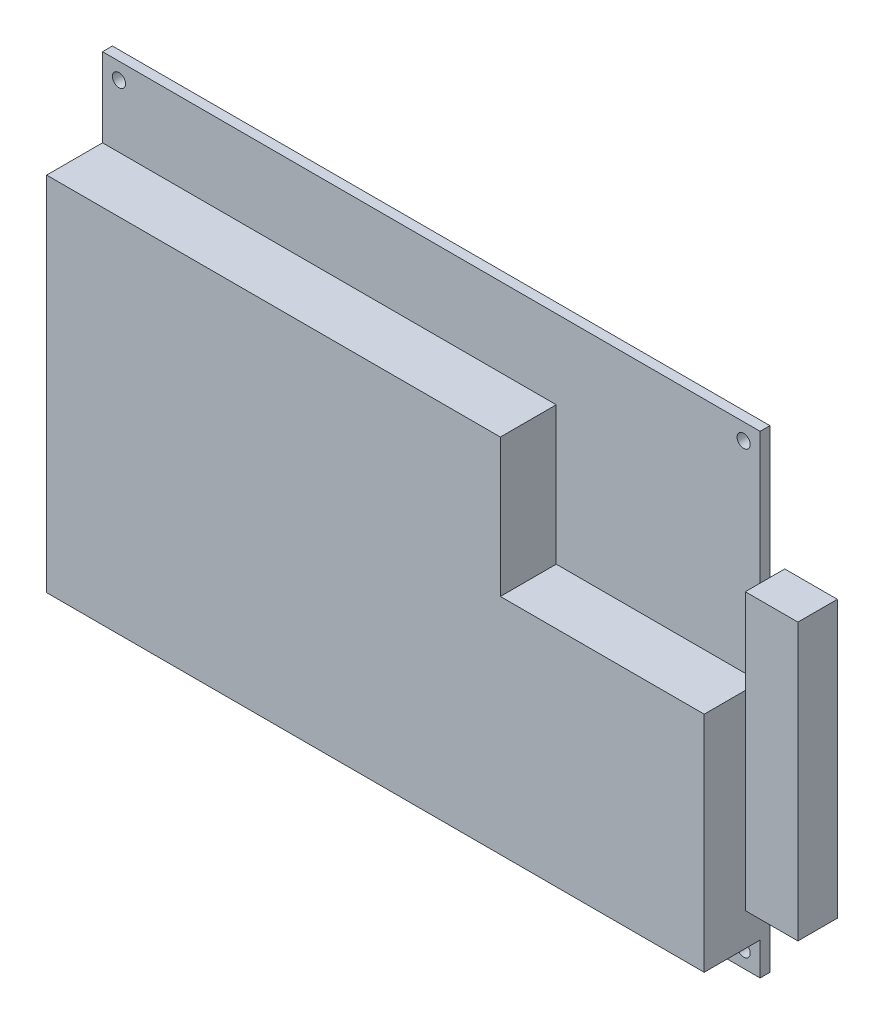
ISO-10303-21;
HEADER;
FILE_DESCRIPTION(('STEP AP214'),'2;1');
FILE_NAME('part.step','',(''),(''),'','','');
FILE_SCHEMA(('AUTOMOTIVE_DESIGN { 1 0 10303 214 1 1 1 1 }'));
ENDSEC;
DATA;
#1=APPLICATION_CONTEXT('core data for automotive mechanical design processes');
#2=APPLICATION_PROTOCOL_DEFINITION('international standard','automotive_design',2000,#1);
#3=PRODUCT_CONTEXT('',#1,'mechanical');
#4=PRODUCT('Part','Part','',(#3));
#5=PRODUCT_RELATED_PRODUCT_CATEGORY('part','',(#4));
#6=PRODUCT_DEFINITION_FORMATION('','',#4);
#7=PRODUCT_DEFINITION_CONTEXT('part definition',#1,'design');
#8=PRODUCT_DEFINITION('design','',#6,#7);
#9=PRODUCT_DEFINITION_SHAPE('','',#8);
#10=(LENGTH_UNIT() NAMED_UNIT(*) SI_UNIT(.MILLI.,.METRE.));
#11=(NAMED_UNIT(*) PLANE_ANGLE_UNIT() SI_UNIT($,.RADIAN.));
#12=(NAMED_UNIT(*) SI_UNIT($,.STERADIAN.) SOLID_ANGLE_UNIT());
#13=UNCERTAINTY_MEASURE_WITH_UNIT(LENGTH_MEASURE(1.E-05),#10,'distance_accuracy_value','');
#14=(GEOMETRIC_REPRESENTATION_CONTEXT(3) GLOBAL_UNCERTAINTY_ASSIGNED_CONTEXT((#13)) GLOBAL_UNIT_ASSIGNED_CONTEXT((#10,
#11,#12)) REPRESENTATION_CONTEXT('',''));
#15=CARTESIAN_POINT('',(0.,0.,0.));
#16=DIRECTION('',(0.,0.,1.));
#17=DIRECTION('',(1.,0.,0.));
#18=AXIS2_PLACEMENT_3D('',#15,#16,#17);
#19=CARTESIAN_POINT('',(100.,72.,1.5));
#20=DIRECTION('',(-1.,0.,0.));
#21=DIRECTION('',(0.,-1.,0.));
#22=AXIS2_PLACEMENT_3D('',#19,#20,#21);
#23=PLANE('',#22);
#24=DIRECTION('',(0.,0.,1.));
#25=VECTOR('',#24,1.);
#26=CARTESIAN_POINT('',(100.,52.,3.75));
#27=LINE('',#26,#25);
#28=CARTESIAN_POINT('',(100.,52.,0.));
#29=VERTEX_POINT('',#28);
#30=CARTESIAN_POINT('',(100.,52.,1.5));
#31=VERTEX_POINT('',#30);
#32=EDGE_CURVE('E11',#29,#31,#27,.T.);
#33=ORIENTED_EDGE('',*,*,#32,.F.);
#34=DIRECTION('',(0.,1.,0.));
#35=VECTOR('',#34,1.);
#36=CARTESIAN_POINT('',(100.,72.,0.));
#37=LINE('',#36,#35);
#38=CARTESIAN_POINT('',(100.,72.,0.));
#39=VERTEX_POINT('',#38);
#40=EDGE_CURVE('E239',#29,#39,#37,.T.);
#41=ORIENTED_EDGE('',*,*,#40,.T.);
#42=DIRECTION('',(0.,0.,-1.));
#43=VECTOR('',#42,1.);
#44=CARTESIAN_POINT('',(100.,72.,1.5));
#45=LINE('',#44,#43);
#46=CARTESIAN_POINT('',(100.,72.,1.5));
#47=VERTEX_POINT('',#46);
#48=EDGE_CURVE('E36',#47,#39,#45,.T.);
#49=ORIENTED_EDGE('',*,*,#48,.F.);
#50=DIRECTION('',(0.,1.,0.));
#51=VECTOR('',#50,1.);
#52=CARTESIAN_POINT('',(100.,72.,1.5));
#53=LINE('',#52,#51);
#54=EDGE_CURVE('E246',#31,#47,#53,.T.);
#55=ORIENTED_EDGE('',*,*,#54,.F.);
#56=EDGE_LOOP('',(#33,#41,#49,#55));
#57=FACE_BOUND('',#56,.T.);
#58=ADVANCED_FACE('F33',(#57),#23,.F.);
#59=DIRECTION('',(0.,-1.,0.));
#60=VECTOR('',#59,1.);
#61=CARTESIAN_POINT('',(100.,52.,3.75));
#62=LINE('',#61,#60);
#63=CARTESIAN_POINT('',(100.,39.,3.75));
#64=VERTEX_POINT('',#63);
#65=CARTESIAN_POINT('',(100.,9.99999999999998,3.75));
#66=VERTEX_POINT('',#65);
#67=EDGE_CURVE('E41',#64,#66,#62,.T.);
#68=ORIENTED_EDGE('',*,*,#67,.F.);
#69=DIRECTION('',(0.,0.,-1.));
#70=VECTOR('',#69,1.);
#71=CARTESIAN_POINT('',(100.,39.,10.));
#72=LINE('',#71,#70);
#73=CARTESIAN_POINT('',(100.,39.,10.));
#74=VERTEX_POINT('',#73);
#75=EDGE_CURVE('E209',#74,#64,#72,.T.);
#76=ORIENTED_EDGE('',*,*,#75,.F.);
#77=DIRECTION('',(0.,1.,0.));
#78=VECTOR('',#77,1.);
#79=CARTESIAN_POINT('',(100.,39.,10.));
#80=LINE('',#79,#78);
#81=CARTESIAN_POINT('',(100.,4.99999999999998,10.));
#82=VERTEX_POINT('',#81);
#83=EDGE_CURVE('E184',#82,#74,#80,.T.);
#84=ORIENTED_EDGE('',*,*,#83,.F.);
#85=DIRECTION('',(0.,0.,-1.));
#86=VECTOR('',#85,1.);
#87=CARTESIAN_POINT('',(100.,4.99999999999998,10.));
#88=LINE('',#87,#86);
#89=CARTESIAN_POINT('',(100.,4.99999999999998,1.5));
#90=VERTEX_POINT('',#89);
#91=EDGE_CURVE('E211',#82,#90,#88,.T.);
#92=ORIENTED_EDGE('',*,*,#91,.T.);
#93=CARTESIAN_POINT('',(100.,0.,1.5));
#94=VERTEX_POINT('',#93);
#95=EDGE_CURVE('E242',#94,#90,#53,.T.);
#96=ORIENTED_EDGE('',*,*,#95,.F.);
#97=DIRECTION('',(0.,0.,-1.));
#98=VECTOR('',#97,1.);
#99=CARTESIAN_POINT('',(100.,0.,1.5));
#100=LINE('',#99,#98);
#101=CARTESIAN_POINT('',(100.,0.,0.));
#102=VERTEX_POINT('',#101);
#103=EDGE_CURVE('E253',#94,#102,#100,.T.);
#104=ORIENTED_EDGE('',*,*,#103,.T.);
#105=CARTESIAN_POINT('',(100.,9.99999999999998,0.));
#106=VERTEX_POINT('',#105);
#107=EDGE_CURVE('E254',#102,#106,#37,.T.);
#108=ORIENTED_EDGE('',*,*,#107,.T.);
#109=DIRECTION('',(0.,0.,-1.));
#110=VECTOR('',#109,1.);
#111=CARTESIAN_POINT('',(100.,9.99999999999998,3.75));
#112=LINE('',#111,#110);
#113=EDGE_CURVE('E51',#66,#106,#112,.T.);
#114=ORIENTED_EDGE('',*,*,#113,.F.);
#115=EDGE_LOOP('',(#68,#76,#84,#92,#96,#104,#108,#114));
#116=FACE_BOUND('',#115,.T.);
#117=ADVANCED_FACE('F342',(#116),#23,.F.);
#118=CARTESIAN_POINT('',(0.,0.,1.5));
#119=DIRECTION('',(0.,0.,-1.));
#120=DIRECTION('',(-1.,0.,0.));
#121=AXIS2_PLACEMENT_3D('',#118,#119,#120);
#122=PLANE('',#121);
#123=CARTESIAN_POINT('',(97.5,69.5,1.5));
#124=DIRECTION('',(0.,0.,1.));
#125=DIRECTION('',(1.,0.,0.));
#126=AXIS2_PLACEMENT_3D('',#123,#124,#125);
#127=CIRCLE('',#126,0.999999999999998);
#128=CARTESIAN_POINT('',(98.5,69.5,1.5));
#129=VERTEX_POINT('',#128);
#130=EDGE_CURVE('E224',#129,#129,#127,.T.);
#131=ORIENTED_EDGE('',*,*,#130,.F.);
#132=EDGE_LOOP('',(#131));
#133=FACE_BOUND('',#132,.T.);
#134=CARTESIAN_POINT('',(2.5,69.5,1.5));
#135=DIRECTION('',(0.,0.,1.));
#136=DIRECTION('',(1.,0.,0.));
#137=AXIS2_PLACEMENT_3D('',#134,#135,#136);
#138=CIRCLE('',#137,1.);
#139=CARTESIAN_POINT('',(3.5,69.5,1.5));
#140=VERTEX_POINT('',#139);
#141=EDGE_CURVE('E230',#140,#140,#138,.T.);
#142=ORIENTED_EDGE('',*,*,#141,.F.);
#143=EDGE_LOOP('',(#142));
#144=FACE_BOUND('',#143,.T.);
#145=DIRECTION('',(-1.,0.,0.));
#146=VECTOR('',#145,1.);
#147=CARTESIAN_POINT('',(0.,60.,1.5));
#148=LINE('',#147,#146);
#149=CARTESIAN_POINT('',(69.,60.,1.5));
#150=VERTEX_POINT('',#149);
#151=CARTESIAN_POINT('',(0.,60.,1.5));
#152=VERTEX_POINT('',#151);
#153=EDGE_CURVE('E182',#150,#152,#148,.T.);
#154=ORIENTED_EDGE('',*,*,#153,.F.);
#155=DIRECTION('',(0.,1.,0.));
#156=VECTOR('',#155,1.);
#157=CARTESIAN_POINT('',(69.,60.,1.5));
#158=LINE('',#157,#156);
#159=CARTESIAN_POINT('',(69.,39.,1.5));
#160=VERTEX_POINT('',#159);
#161=EDGE_CURVE('E195',#160,#150,#158,.T.);
#162=ORIENTED_EDGE('',*,*,#161,.F.);
#163=DIRECTION('',(-1.,0.,0.));
#164=VECTOR('',#163,1.);
#165=CARTESIAN_POINT('',(69.,39.,1.5));
#166=LINE('',#165,#164);
#167=CARTESIAN_POINT('',(100.,39.,1.5));
#168=VERTEX_POINT('',#167);
#169=EDGE_CURVE('E172',#168,#160,#166,.T.);
#170=ORIENTED_EDGE('',*,*,#169,.F.);
#171=EDGE_CURVE('E245',#168,#31,#53,.T.);
#172=ORIENTED_EDGE('',*,*,#171,.T.);
#173=ORIENTED_EDGE('',*,*,#54,.T.);
#174=DIRECTION('',(-1.,0.,0.));
#175=VECTOR('',#174,1.);
#176=CARTESIAN_POINT('',(100.,72.,1.5));
#177=LINE('',#176,#175);
#178=CARTESIAN_POINT('',(0.,72.,1.5));
#179=VERTEX_POINT('',#178);
#180=EDGE_CURVE('E244',#47,#179,#177,.T.);
#181=ORIENTED_EDGE('',*,*,#180,.T.);
#182=DIRECTION('',(0.,-1.,0.));
#183=VECTOR('',#182,1.);
#184=CARTESIAN_POINT('',(0.,72.,1.5));
#185=LINE('',#184,#183);
#186=EDGE_CURVE('E249',#179,#152,#185,.T.);
#187=ORIENTED_EDGE('',*,*,#186,.T.);
#188=EDGE_LOOP('',(#154,#162,#170,#172,#173,#181,#187));
#189=FACE_BOUND('',#188,.T.);
#190=ADVANCED_FACE('F313',(#133,#144,#189),#122,.F.);
#191=CARTESIAN_POINT('',(97.5,2.49999999999999,1.5));
#192=DIRECTION('',(0.,0.,1.));
#193=DIRECTION('',(1.,0.,0.));
#194=AXIS2_PLACEMENT_3D('',#191,#192,#193);
#195=CIRCLE('',#194,0.999999999999998);
#196=CARTESIAN_POINT('',(98.5,2.49999999999999,1.5));
#197=VERTEX_POINT('',#196);
#198=EDGE_CURVE('E218',#197,#197,#195,.T.);
#199=ORIENTED_EDGE('',*,*,#198,.F.);
#200=EDGE_LOOP('',(#199));
#201=FACE_BOUND('',#200,.T.);
#202=CARTESIAN_POINT('',(2.5,2.49999999999999,1.5));
#203=DIRECTION('',(0.,0.,1.));
#204=DIRECTION('',(1.,0.,0.));
#205=AXIS2_PLACEMENT_3D('',#202,#203,#204);
#206=CIRCLE('',#205,1.);
#207=CARTESIAN_POINT('',(3.5,2.49999999999999,1.5));
#208=VERTEX_POINT('',#207);
#209=EDGE_CURVE('E236',#208,#208,#206,.T.);
#210=ORIENTED_EDGE('',*,*,#209,.F.);
#211=EDGE_LOOP('',(#210));
#212=FACE_BOUND('',#211,.T.);
#213=DIRECTION('',(1.,0.,0.));
#214=VECTOR('',#213,1.);
#215=CARTESIAN_POINT('',(100.,4.99999999999998,1.5));
#216=LINE('',#215,#214);
#217=CARTESIAN_POINT('',(0.,4.99999999999996,1.5));
#218=VERTEX_POINT('',#217);
#219=EDGE_CURVE('E169',#218,#90,#216,.T.);
#220=ORIENTED_EDGE('',*,*,#219,.F.);
#221=CARTESIAN_POINT('',(0.,0.,1.5));
#222=VERTEX_POINT('',#221);
#223=EDGE_CURVE('E248',#218,#222,#185,.T.);
#224=ORIENTED_EDGE('',*,*,#223,.T.);
#225=DIRECTION('',(1.,0.,0.));
#226=VECTOR('',#225,1.);
#227=CARTESIAN_POINT('',(100.,0.,1.5));
#228=LINE('',#227,#226);
#229=EDGE_CURVE('E251',#222,#94,#228,.T.);
#230=ORIENTED_EDGE('',*,*,#229,.T.);
#231=ORIENTED_EDGE('',*,*,#95,.T.);
#232=EDGE_LOOP('',(#220,#224,#230,#231));
#233=FACE_BOUND('',#232,.T.);
#234=ADVANCED_FACE('F350',(#201,#212,#233),#122,.F.);
#235=CARTESIAN_POINT('',(0.,0.,0.));
#236=DIRECTION('',(0.,0.,-1.));
#237=DIRECTION('',(-1.,0.,0.));
#238=AXIS2_PLACEMENT_3D('',#235,#236,#237);
#239=PLANE('',#238);
#240=CARTESIAN_POINT('',(97.5,69.5,0.));
#241=DIRECTION('',(0.,0.,1.));
#242=DIRECTION('',(1.,0.,0.));
#243=AXIS2_PLACEMENT_3D('',#240,#241,#242);
#244=CIRCLE('',#243,0.999999999999998);
#245=CARTESIAN_POINT('',(98.5,69.5,0.));
#246=VERTEX_POINT('',#245);
#247=EDGE_CURVE('E221',#246,#246,#244,.T.);
#248=ORIENTED_EDGE('',*,*,#247,.T.);
#249=EDGE_LOOP('',(#248));
#250=FACE_BOUND('',#249,.T.);
#251=CARTESIAN_POINT('',(2.5,2.49999999999999,0.));
#252=DIRECTION('',(0.,0.,1.));
#253=DIRECTION('',(1.,0.,0.));
#254=AXIS2_PLACEMENT_3D('',#251,#252,#253);
#255=CIRCLE('',#254,1.);
#256=CARTESIAN_POINT('',(3.5,2.49999999999999,0.));
#257=VERTEX_POINT('',#256);
#258=EDGE_CURVE('E233',#257,#257,#255,.T.);
#259=ORIENTED_EDGE('',*,*,#258,.T.);
#260=EDGE_LOOP('',(#259));
#261=FACE_BOUND('',#260,.T.);
#262=ORIENTED_EDGE('',*,*,#107,.F.);
#263=DIRECTION('',(1.,0.,0.));
#264=VECTOR('',#263,1.);
#265=CARTESIAN_POINT('',(100.,0.,0.));
#266=LINE('',#265,#264);
#267=CARTESIAN_POINT('',(0.,0.,0.));
#268=VERTEX_POINT('',#267);
#269=EDGE_CURVE('E261',#268,#102,#266,.T.);
#270=ORIENTED_EDGE('',*,*,#269,.F.);
#271=DIRECTION('',(0.,-1.,0.));
#272=VECTOR('',#271,1.);
#273=CARTESIAN_POINT('',(0.,72.,0.));
#274=LINE('',#273,#272);
#275=CARTESIAN_POINT('',(0.,72.,0.));
#276=VERTEX_POINT('',#275);
#277=EDGE_CURVE('E259',#276,#268,#274,.T.);
#278=ORIENTED_EDGE('',*,*,#277,.F.);
#279=DIRECTION('',(-1.,0.,0.));
#280=VECTOR('',#279,1.);
#281=CARTESIAN_POINT('',(100.,72.,0.));
#282=LINE('',#281,#280);
#283=EDGE_CURVE('E256',#39,#276,#282,.T.);
#284=ORIENTED_EDGE('',*,*,#283,.F.);
#285=ORIENTED_EDGE('',*,*,#40,.F.);
#286=EDGE_CURVE('E257',#106,#29,#37,.T.);
#287=ORIENTED_EDGE('',*,*,#286,.F.);
#288=EDGE_LOOP('',(#262,#270,#278,#284,#285,#287));
#289=FACE_BOUND('',#288,.T.);
#290=CARTESIAN_POINT('',(2.5,69.5,0.));
#291=DIRECTION('',(0.,0.,1.));
#292=DIRECTION('',(1.,0.,0.));
#293=AXIS2_PLACEMENT_3D('',#290,#291,#292);
#294=CIRCLE('',#293,1.);
#295=CARTESIAN_POINT('',(3.5,69.5,0.));
#296=VERTEX_POINT('',#295);
#297=EDGE_CURVE('E227',#296,#296,#294,.T.);
#298=ORIENTED_EDGE('',*,*,#297,.T.);
#299=EDGE_LOOP('',(#298));
#300=FACE_BOUND('',#299,.T.);
#301=CARTESIAN_POINT('',(97.5,2.49999999999999,0.));
#302=DIRECTION('',(0.,0.,1.));
#303=DIRECTION('',(1.,0.,0.));
#304=AXIS2_PLACEMENT_3D('',#301,#302,#303);
#305=CIRCLE('',#304,0.999999999999998);
#306=CARTESIAN_POINT('',(98.5,2.49999999999999,0.));
#307=VERTEX_POINT('',#306);
#308=EDGE_CURVE('E217',#307,#307,#305,.T.);
#309=ORIENTED_EDGE('',*,*,#308,.T.);
#310=EDGE_LOOP('',(#309));
#311=FACE_BOUND('',#310,.T.);
#312=ADVANCED_FACE('F305',(#250,#261,#289,#300,#311),#239,.T.);
#313=CARTESIAN_POINT('',(100.,72.,1.5));
#314=DIRECTION('',(0.,-1.,0.));
#315=DIRECTION('',(1.,0.,0.));
#316=AXIS2_PLACEMENT_3D('',#313,#314,#315);
#317=PLANE('',#316);
#318=ORIENTED_EDGE('',*,*,#283,.T.);
#319=DIRECTION('',(0.,0.,-1.));
#320=VECTOR('',#319,1.);
#321=CARTESIAN_POINT('',(0.,72.,1.5));
#322=LINE('',#321,#320);
#323=EDGE_CURVE('E267',#179,#276,#322,.T.);
#324=ORIENTED_EDGE('',*,*,#323,.F.);
#325=ORIENTED_EDGE('',*,*,#180,.F.);
#326=ORIENTED_EDGE('',*,*,#48,.T.);
#327=EDGE_LOOP('',(#318,#324,#325,#326));
#328=FACE_BOUND('',#327,.T.);
#329=ADVANCED_FACE('F308',(#328),#317,.F.);
#330=CARTESIAN_POINT('',(0.,72.,1.5));
#331=DIRECTION('',(1.,0.,0.));
#332=DIRECTION('',(0.,1.,0.));
#333=AXIS2_PLACEMENT_3D('',#330,#331,#332);
#334=PLANE('',#333);
#335=ORIENTED_EDGE('',*,*,#277,.T.);
#336=DIRECTION('',(0.,0.,-1.));
#337=VECTOR('',#336,1.);
#338=CARTESIAN_POINT('',(0.,0.,1.5));
#339=LINE('',#338,#337);
#340=EDGE_CURVE('E265',#222,#268,#339,.T.);
#341=ORIENTED_EDGE('',*,*,#340,.F.);
#342=ORIENTED_EDGE('',*,*,#223,.F.);
#343=DIRECTION('',(0.,0.,-1.));
#344=VECTOR('',#343,1.);
#345=CARTESIAN_POINT('',(0.,4.99999999999996,10.));
#346=LINE('',#345,#344);
#347=CARTESIAN_POINT('',(0.,4.99999999999996,10.));
#348=VERTEX_POINT('',#347);
#349=EDGE_CURVE('E214',#348,#218,#346,.T.);
#350=ORIENTED_EDGE('',*,*,#349,.F.);
#351=DIRECTION('',(0.,-1.,0.));
#352=VECTOR('',#351,1.);
#353=CARTESIAN_POINT('',(0.,4.99999999999996,10.));
#354=LINE('',#353,#352);
#355=CARTESIAN_POINT('',(0.,60.,10.));
#356=VERTEX_POINT('',#355);
#357=EDGE_CURVE('E178',#356,#348,#354,.T.);
#358=ORIENTED_EDGE('',*,*,#357,.F.);
#359=DIRECTION('',(0.,0.,-1.));
#360=VECTOR('',#359,1.);
#361=CARTESIAN_POINT('',(0.,60.,10.));
#362=LINE('',#361,#360);
#363=EDGE_CURVE('E191',#356,#152,#362,.T.);
#364=ORIENTED_EDGE('',*,*,#363,.T.);
#365=ORIENTED_EDGE('',*,*,#186,.F.);
#366=ORIENTED_EDGE('',*,*,#323,.T.);
#367=EDGE_LOOP('',(#335,#341,#342,#350,#358,#364,#365,#366));
#368=FACE_BOUND('',#367,.T.);
#369=ADVANCED_FACE('F309',(#368),#334,.F.);
#370=CARTESIAN_POINT('',(100.,0.,1.5));
#371=DIRECTION('',(0.,1.,0.));
#372=DIRECTION('',(-1.,0.,0.));
#373=AXIS2_PLACEMENT_3D('',#370,#371,#372);
#374=PLANE('',#373);
#375=ORIENTED_EDGE('',*,*,#269,.T.);
#376=ORIENTED_EDGE('',*,*,#103,.F.);
#377=ORIENTED_EDGE('',*,*,#229,.F.);
#378=ORIENTED_EDGE('',*,*,#340,.T.);
#379=EDGE_LOOP('',(#375,#376,#377,#378));
#380=FACE_BOUND('',#379,.T.);
#381=ADVANCED_FACE('F366',(#380),#374,.F.);
#382=CARTESIAN_POINT('',(2.5,2.49999999999999,1.5));
#383=DIRECTION('',(0.,0.,-1.));
#384=DIRECTION('',(-1.,0.,0.));
#385=AXIS2_PLACEMENT_3D('',#382,#383,#384);
#386=CYLINDRICAL_SURFACE('',#385,1.);
#387=ORIENTED_EDGE('',*,*,#209,.T.);
#388=EDGE_LOOP('',(#387));
#389=FACE_BOUND('',#388,.T.);
#390=ORIENTED_EDGE('',*,*,#258,.F.);
#391=EDGE_LOOP('',(#390));
#392=FACE_BOUND('',#391,.T.);
#393=ADVANCED_FACE('F362',(#389,#392),#386,.F.);
#394=CARTESIAN_POINT('',(2.5,69.5,1.5));
#395=DIRECTION('',(0.,0.,-1.));
#396=DIRECTION('',(-1.,0.,0.));
#397=AXIS2_PLACEMENT_3D('',#394,#395,#396);
#398=CYLINDRICAL_SURFACE('',#397,1.);
#399=ORIENTED_EDGE('',*,*,#141,.T.);
#400=EDGE_LOOP('',(#399));
#401=FACE_BOUND('',#400,.T.);
#402=ORIENTED_EDGE('',*,*,#297,.F.);
#403=EDGE_LOOP('',(#402));
#404=FACE_BOUND('',#403,.T.);
#405=ADVANCED_FACE('F387',(#401,#404),#398,.F.);
#406=CARTESIAN_POINT('',(97.5,69.5,1.5));
#407=DIRECTION('',(0.,0.,-1.));
#408=DIRECTION('',(-1.,0.,0.));
#409=AXIS2_PLACEMENT_3D('',#406,#407,#408);
#410=CYLINDRICAL_SURFACE('',#409,0.999999999999998);
#411=ORIENTED_EDGE('',*,*,#130,.T.);
#412=EDGE_LOOP('',(#411));
#413=FACE_BOUND('',#412,.T.);
#414=ORIENTED_EDGE('',*,*,#247,.F.);
#415=EDGE_LOOP('',(#414));
#416=FACE_BOUND('',#415,.T.);
#417=ADVANCED_FACE('F394',(#413,#416),#410,.F.);
#418=CARTESIAN_POINT('',(97.5,2.49999999999999,1.5));
#419=DIRECTION('',(0.,0.,-1.));
#420=DIRECTION('',(-1.,0.,0.));
#421=AXIS2_PLACEMENT_3D('',#418,#419,#420);
#422=CYLINDRICAL_SURFACE('',#421,0.999999999999998);
#423=ORIENTED_EDGE('',*,*,#198,.T.);
#424=EDGE_LOOP('',(#423));
#425=FACE_BOUND('',#424,.T.);
#426=ORIENTED_EDGE('',*,*,#308,.F.);
#427=EDGE_LOOP('',(#426));
#428=FACE_BOUND('',#427,.T.);
#429=ADVANCED_FACE('F401',(#425,#428),#422,.F.);
#430=CARTESIAN_POINT('',(100.,4.99999999999998,10.));
#431=DIRECTION('',(0.,1.,0.));
#432=DIRECTION('',(0.,0.,1.));
#433=AXIS2_PLACEMENT_3D('',#430,#431,#432);
#434=PLANE('',#433);
#435=ORIENTED_EDGE('',*,*,#219,.T.);
#436=ORIENTED_EDGE('',*,*,#91,.F.);
#437=DIRECTION('',(1.,0.,0.));
#438=VECTOR('',#437,1.);
#439=CARTESIAN_POINT('',(69.,4.99999999999998,10.));
#440=LINE('',#439,#438);
#441=EDGE_CURVE('E181',#348,#82,#440,.T.);
#442=ORIENTED_EDGE('',*,*,#441,.F.);
#443=ORIENTED_EDGE('',*,*,#349,.T.);
#444=EDGE_LOOP('',(#435,#436,#442,#443));
#445=FACE_BOUND('',#444,.T.);
#446=ADVANCED_FACE('F409',(#445),#434,.F.);
#447=CARTESIAN_POINT('',(69.,39.,10.));
#448=DIRECTION('',(0.,-1.,0.));
#449=DIRECTION('',(0.,0.,-1.));
#450=AXIS2_PLACEMENT_3D('',#447,#448,#449);
#451=PLANE('',#450);
#452=ORIENTED_EDGE('',*,*,#169,.T.);
#453=DIRECTION('',(0.,0.,-1.));
#454=VECTOR('',#453,1.);
#455=CARTESIAN_POINT('',(69.,39.,10.));
#456=LINE('',#455,#454);
#457=CARTESIAN_POINT('',(69.,39.,10.));
#458=VERTEX_POINT('',#457);
#459=EDGE_CURVE('E205',#458,#160,#456,.T.);
#460=ORIENTED_EDGE('',*,*,#459,.F.);
#461=DIRECTION('',(-1.,0.,0.));
#462=VECTOR('',#461,1.);
#463=CARTESIAN_POINT('',(69.,39.,10.));
#464=LINE('',#463,#462);
#465=EDGE_CURVE('E186',#74,#458,#464,.T.);
#466=ORIENTED_EDGE('',*,*,#465,.F.);
#467=ORIENTED_EDGE('',*,*,#75,.T.);
#468=EDGE_CURVE('E208',#64,#168,#72,.T.);
#469=ORIENTED_EDGE('',*,*,#468,.T.);
#470=EDGE_LOOP('',(#452,#460,#466,#467,#469));
#471=FACE_BOUND('',#470,.T.);
#472=ADVANCED_FACE('F326',(#471),#451,.F.);
#473=CARTESIAN_POINT('',(69.,60.,10.));
#474=DIRECTION('',(-1.,0.,0.));
#475=DIRECTION('',(0.,0.,1.));
#476=AXIS2_PLACEMENT_3D('',#473,#474,#475);
#477=PLANE('',#476);
#478=ORIENTED_EDGE('',*,*,#161,.T.);
#479=DIRECTION('',(0.,0.,-1.));
#480=VECTOR('',#479,1.);
#481=CARTESIAN_POINT('',(69.,60.,10.));
#482=LINE('',#481,#480);
#483=CARTESIAN_POINT('',(69.,60.,10.));
#484=VERTEX_POINT('',#483);
#485=EDGE_CURVE('E202',#484,#150,#482,.T.);
#486=ORIENTED_EDGE('',*,*,#485,.F.);
#487=DIRECTION('',(0.,1.,0.));
#488=VECTOR('',#487,1.);
#489=CARTESIAN_POINT('',(69.,60.,10.));
#490=LINE('',#489,#488);
#491=EDGE_CURVE('E188',#458,#484,#490,.T.);
#492=ORIENTED_EDGE('',*,*,#491,.F.);
#493=ORIENTED_EDGE('',*,*,#459,.T.);
#494=EDGE_LOOP('',(#478,#486,#492,#493));
#495=FACE_BOUND('',#494,.T.);
#496=ADVANCED_FACE('F320',(#495),#477,.F.);
#497=CARTESIAN_POINT('',(0.,60.,10.));
#498=DIRECTION('',(0.,-1.,0.));
#499=DIRECTION('',(1.,0.,0.));
#500=AXIS2_PLACEMENT_3D('',#497,#498,#499);
#501=PLANE('',#500);
#502=ORIENTED_EDGE('',*,*,#153,.T.);
#503=ORIENTED_EDGE('',*,*,#363,.F.);
#504=DIRECTION('',(-1.,0.,0.));
#505=VECTOR('',#504,1.);
#506=CARTESIAN_POINT('',(0.,60.,10.));
#507=LINE('',#506,#505);
#508=EDGE_CURVE('E190',#484,#356,#507,.T.);
#509=ORIENTED_EDGE('',*,*,#508,.F.);
#510=ORIENTED_EDGE('',*,*,#485,.T.);
#511=EDGE_LOOP('',(#502,#503,#509,#510));
#512=FACE_BOUND('',#511,.T.);
#513=ADVANCED_FACE('F315',(#512),#501,.F.);
#514=CARTESIAN_POINT('',(0.,0.,10.));
#515=DIRECTION('',(0.,0.,-1.));
#516=DIRECTION('',(-1.,0.,0.));
#517=AXIS2_PLACEMENT_3D('',#514,#515,#516);
#518=PLANE('',#517);
#519=ORIENTED_EDGE('',*,*,#357,.T.);
#520=ORIENTED_EDGE('',*,*,#441,.T.);
#521=ORIENTED_EDGE('',*,*,#83,.T.);
#522=ORIENTED_EDGE('',*,*,#465,.T.);
#523=ORIENTED_EDGE('',*,*,#491,.T.);
#524=ORIENTED_EDGE('',*,*,#508,.T.);
#525=EDGE_LOOP('',(#519,#520,#521,#522,#523,#524));
#526=FACE_BOUND('',#525,.T.);
#527=ADVANCED_FACE('F340',(#526),#518,.F.);
#528=CARTESIAN_POINT('',(100.,0.,0.));
#529=DIRECTION('',(1.,0.,0.));
#530=DIRECTION('',(0.,1.,0.));
#531=AXIS2_PLACEMENT_3D('',#528,#529,#530);
#532=PLANE('',#531);
#533=CARTESIAN_POINT('',(100.,9.99999999999998,-2.25000000000001));
#534=VERTEX_POINT('',#533);
#535=EDGE_CURVE('E281',#106,#534,#112,.T.);
#536=ORIENTED_EDGE('',*,*,#535,.F.);
#537=ORIENTED_EDGE('',*,*,#286,.T.);
#538=CARTESIAN_POINT('',(100.,52.,-2.25));
#539=VERTEX_POINT('',#538);
#540=EDGE_CURVE('E43',#539,#29,#27,.T.);
#541=ORIENTED_EDGE('',*,*,#540,.F.);
#542=DIRECTION('',(0.,1.,0.));
#543=VECTOR('',#542,1.);
#544=CARTESIAN_POINT('',(100.,52.,-2.25));
#545=LINE('',#544,#543);
#546=EDGE_CURVE('E284',#534,#539,#545,.T.);
#547=ORIENTED_EDGE('',*,*,#546,.F.);
#548=EDGE_LOOP('',(#536,#537,#541,#547));
#549=FACE_BOUND('',#548,.T.);
#550=ADVANCED_FACE('F298',(#549),#532,.F.);
#551=CARTESIAN_POINT('',(108.,52.,3.75));
#552=DIRECTION('',(0.,0.,-1.));
#553=DIRECTION('',(0.,1.,0.));
#554=AXIS2_PLACEMENT_3D('',#551,#552,#553);
#555=PLANE('',#554);
#556=CARTESIAN_POINT('',(100.,52.,3.75));
#557=VERTEX_POINT('',#556);
#558=EDGE_CURVE('E278',#557,#64,#62,.T.);
#559=ORIENTED_EDGE('',*,*,#558,.T.);
#560=ORIENTED_EDGE('',*,*,#67,.T.);
#561=DIRECTION('',(-1.,0.,0.));
#562=VECTOR('',#561,1.);
#563=CARTESIAN_POINT('',(108.,9.99999999999998,3.75));
#564=LINE('',#563,#562);
#565=CARTESIAN_POINT('',(108.,9.99999999999998,3.75));
#566=VERTEX_POINT('',#565);
#567=EDGE_CURVE('E151',#566,#66,#564,.T.);
#568=ORIENTED_EDGE('',*,*,#567,.F.);
#569=DIRECTION('',(0.,-1.,0.));
#570=VECTOR('',#569,1.);
#571=CARTESIAN_POINT('',(108.,52.,3.75));
#572=LINE('',#571,#570);
#573=CARTESIAN_POINT('',(108.,52.,3.75));
#574=VERTEX_POINT('',#573);
#575=EDGE_CURVE('E157',#574,#566,#572,.T.);
#576=ORIENTED_EDGE('',*,*,#575,.F.);
#577=DIRECTION('',(-1.,0.,0.));
#578=VECTOR('',#577,1.);
#579=CARTESIAN_POINT('',(108.,52.,3.75));
#580=LINE('',#579,#578);
#581=EDGE_CURVE('E288',#574,#557,#580,.T.);
#582=ORIENTED_EDGE('',*,*,#581,.T.);
#583=EDGE_LOOP('',(#559,#560,#568,#576,#582));
#584=FACE_BOUND('',#583,.T.);
#585=ADVANCED_FACE('F168',(#584),#555,.F.);
#586=CARTESIAN_POINT('',(108.,9.99999999999998,3.75));
#587=DIRECTION('',(0.,1.,0.));
#588=DIRECTION('',(-1.,0.,0.));
#589=AXIS2_PLACEMENT_3D('',#586,#587,#588);
#590=PLANE('',#589);
#591=ORIENTED_EDGE('',*,*,#113,.T.);
#592=ORIENTED_EDGE('',*,*,#535,.T.);
#593=DIRECTION('',(-1.,0.,0.));
#594=VECTOR('',#593,1.);
#595=CARTESIAN_POINT('',(108.,9.99999999999998,-2.25000000000001));
#596=LINE('',#595,#594);
#597=CARTESIAN_POINT('',(108.,9.99999999999998,-2.25000000000001));
#598=VERTEX_POINT('',#597);
#599=EDGE_CURVE('E153',#598,#534,#596,.T.);
#600=ORIENTED_EDGE('',*,*,#599,.F.);
#601=DIRECTION('',(0.,0.,-1.));
#602=VECTOR('',#601,1.);
#603=CARTESIAN_POINT('',(108.,9.99999999999998,3.75));
#604=LINE('',#603,#602);
#605=EDGE_CURVE('E147',#566,#598,#604,.T.);
#606=ORIENTED_EDGE('',*,*,#605,.F.);
#607=ORIENTED_EDGE('',*,*,#567,.T.);
#608=EDGE_LOOP('',(#591,#592,#600,#606,#607));
#609=FACE_BOUND('',#608,.T.);
#610=ADVANCED_FACE('F149',(#609),#590,.F.);
#611=CARTESIAN_POINT('',(108.,52.,-2.25));
#612=DIRECTION('',(0.,0.,1.));
#613=DIRECTION('',(0.,-1.,0.));
#614=AXIS2_PLACEMENT_3D('',#611,#612,#613);
#615=PLANE('',#614);
#616=ORIENTED_EDGE('',*,*,#546,.T.);
#617=DIRECTION('',(-1.,0.,0.));
#618=VECTOR('',#617,1.);
#619=CARTESIAN_POINT('',(108.,52.,-2.25));
#620=LINE('',#619,#618);
#621=CARTESIAN_POINT('',(108.,52.,-2.25));
#622=VERTEX_POINT('',#621);
#623=EDGE_CURVE('E174',#622,#539,#620,.T.);
#624=ORIENTED_EDGE('',*,*,#623,.F.);
#625=DIRECTION('',(0.,1.,0.));
#626=VECTOR('',#625,1.);
#627=CARTESIAN_POINT('',(108.,52.,-2.25));
#628=LINE('',#627,#626);
#629=EDGE_CURVE('E156',#598,#622,#628,.T.);
#630=ORIENTED_EDGE('',*,*,#629,.F.);
#631=ORIENTED_EDGE('',*,*,#599,.T.);
#632=EDGE_LOOP('',(#616,#624,#630,#631));
#633=FACE_BOUND('',#632,.T.);
#634=ADVANCED_FACE('F483',(#633),#615,.F.);
#635=CARTESIAN_POINT('',(108.,52.,3.75));
#636=DIRECTION('',(0.,-1.,0.));
#637=DIRECTION('',(1.,0.,0.));
#638=AXIS2_PLACEMENT_3D('',#635,#636,#637);
#639=PLANE('',#638);
#640=ORIENTED_EDGE('',*,*,#540,.T.);
#641=ORIENTED_EDGE('',*,*,#32,.T.);
#642=EDGE_CURVE('E44',#31,#557,#27,.T.);
#643=ORIENTED_EDGE('',*,*,#642,.T.);
#644=ORIENTED_EDGE('',*,*,#581,.F.);
#645=DIRECTION('',(0.,0.,1.));
#646=VECTOR('',#645,1.);
#647=CARTESIAN_POINT('',(108.,52.,3.75));
#648=LINE('',#647,#646);
#649=EDGE_CURVE('E162',#622,#574,#648,.T.);
#650=ORIENTED_EDGE('',*,*,#649,.F.);
#651=ORIENTED_EDGE('',*,*,#623,.T.);
#652=EDGE_LOOP('',(#640,#641,#643,#644,#650,#651));
#653=FACE_BOUND('',#652,.T.);
#654=ADVANCED_FACE('F293',(#653),#639,.F.);
#655=CARTESIAN_POINT('',(108.,0.,0.));
#656=DIRECTION('',(1.,0.,0.));
#657=DIRECTION('',(0.,1.,0.));
#658=AXIS2_PLACEMENT_3D('',#655,#656,#657);
#659=PLANE('',#658);
#660=ORIENTED_EDGE('',*,*,#575,.T.);
#661=ORIENTED_EDGE('',*,*,#605,.T.);
#662=ORIENTED_EDGE('',*,*,#629,.T.);
#663=ORIENTED_EDGE('',*,*,#649,.T.);
#664=EDGE_LOOP('',(#660,#661,#662,#663));
#665=FACE_BOUND('',#664,.T.);
#666=ADVANCED_FACE('F160',(#665),#659,.T.);
#667=ORIENTED_EDGE('',*,*,#171,.F.);
#668=ORIENTED_EDGE('',*,*,#468,.F.);
#669=ORIENTED_EDGE('',*,*,#558,.F.);
#670=ORIENTED_EDGE('',*,*,#642,.F.);
#671=EDGE_LOOP('',(#667,#668,#669,#670));
#672=FACE_BOUND('',#671,.T.);
#673=ADVANCED_FACE('F330',(#672),#532,.F.);
#674=CLOSED_SHELL('',(#58,#117,#190,#234,#312,#329,#369,#381,#393,#405,#417,#429,#446,#472,#496,
#513,#527,#550,#585,#610,#634,#654,#666,#673));
#675=MANIFOLD_SOLID_BREP('B2',#674);
#676=ADVANCED_BREP_SHAPE_REPRESENTATION('',(#18,#675),#14);
#677=SHAPE_DEFINITION_REPRESENTATION(#9,#676);
ENDSEC;
END-ISO-10303-21;
